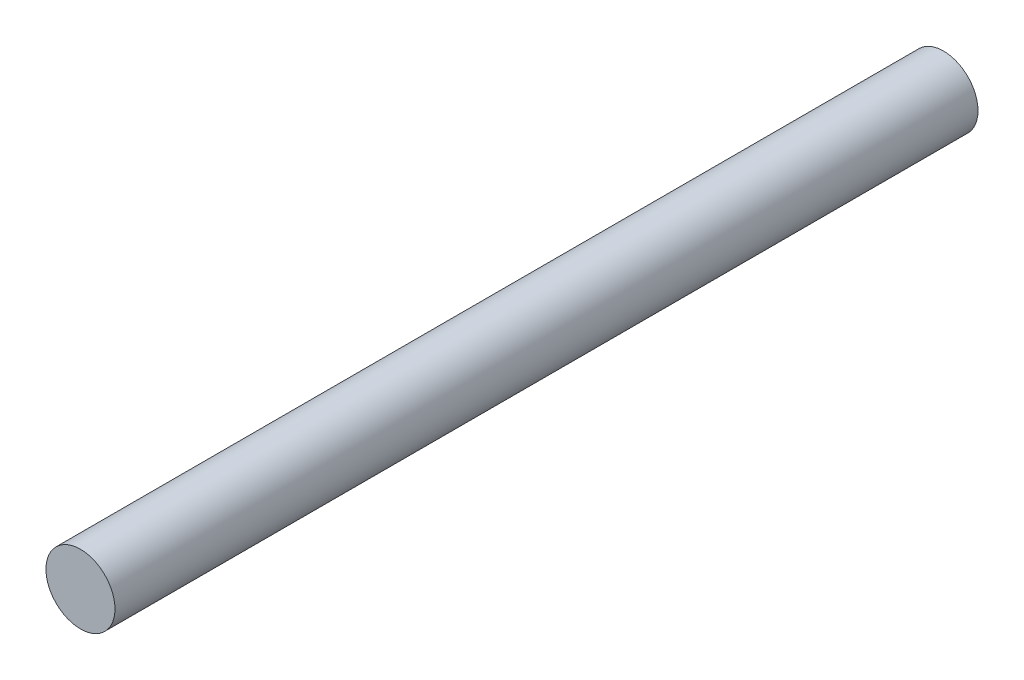
ISO-10303-21;
HEADER;
FILE_DESCRIPTION(('STEP AP214'),'2;1');
FILE_NAME('part.step','',(''),(''),'','','');
FILE_SCHEMA(('AUTOMOTIVE_DESIGN { 1 0 10303 214 1 1 1 1 }'));
ENDSEC;
DATA;
#1=APPLICATION_CONTEXT('core data for automotive mechanical design processes');
#2=APPLICATION_PROTOCOL_DEFINITION('international standard','automotive_design',2000,#1);
#3=PRODUCT_CONTEXT('',#1,'mechanical');
#4=PRODUCT('Part','Part','',(#3));
#5=PRODUCT_RELATED_PRODUCT_CATEGORY('part','',(#4));
#6=PRODUCT_DEFINITION_FORMATION('','',#4);
#7=PRODUCT_DEFINITION_CONTEXT('part definition',#1,'design');
#8=PRODUCT_DEFINITION('design','',#6,#7);
#9=PRODUCT_DEFINITION_SHAPE('','',#8);
#10=(LENGTH_UNIT() NAMED_UNIT(*) SI_UNIT(.MILLI.,.METRE.));
#11=(NAMED_UNIT(*) PLANE_ANGLE_UNIT() SI_UNIT($,.RADIAN.));
#12=(NAMED_UNIT(*) SI_UNIT($,.STERADIAN.) SOLID_ANGLE_UNIT());
#13=UNCERTAINTY_MEASURE_WITH_UNIT(LENGTH_MEASURE(1.E-05),#10,'distance_accuracy_value','');
#14=(GEOMETRIC_REPRESENTATION_CONTEXT(3) GLOBAL_UNCERTAINTY_ASSIGNED_CONTEXT((#13)) GLOBAL_UNIT_ASSIGNED_CONTEXT((#10,
#11,#12)) REPRESENTATION_CONTEXT('',''));
#15=CARTESIAN_POINT('',(0.,0.,0.));
#16=DIRECTION('',(0.,0.,1.));
#17=DIRECTION('',(1.,0.,0.));
#18=AXIS2_PLACEMENT_3D('',#15,#16,#17);
#19=CARTESIAN_POINT('',(0.,0.,125.));
#20=DIRECTION('',(0.,0.,-1.));
#21=DIRECTION('',(-1.,0.,0.));
#22=AXIS2_PLACEMENT_3D('',#19,#20,#21);
#23=CYLINDRICAL_SURFACE('',#22,5.);
#24=CARTESIAN_POINT('',(0.,0.,125.));
#25=DIRECTION('',(0.,0.,1.));
#26=DIRECTION('',(1.,0.,0.));
#27=AXIS2_PLACEMENT_3D('',#24,#25,#26);
#28=CIRCLE('',#27,5.);
#29=CARTESIAN_POINT('',(5.,0.,125.));
#30=VERTEX_POINT('',#29);
#31=EDGE_CURVE('E10',#30,#30,#28,.T.);
#32=ORIENTED_EDGE('',*,*,#31,.F.);
#33=EDGE_LOOP('',(#32));
#34=FACE_BOUND('',#33,.T.);
#35=CARTESIAN_POINT('',(0.,0.,0.));
#36=DIRECTION('',(0.,0.,1.));
#37=DIRECTION('',(1.,0.,0.));
#38=AXIS2_PLACEMENT_3D('',#35,#36,#37);
#39=CIRCLE('',#38,5.);
#40=CARTESIAN_POINT('',(5.,0.,0.));
#41=VERTEX_POINT('',#40);
#42=EDGE_CURVE('E44',#41,#41,#39,.T.);
#43=ORIENTED_EDGE('',*,*,#42,.T.);
#44=EDGE_LOOP('',(#43));
#45=FACE_BOUND('',#44,.T.);
#46=ADVANCED_FACE('F41',(#34,#45),#23,.T.);
#47=CARTESIAN_POINT('',(0.,0.,125.));
#48=DIRECTION('',(0.,0.,1.));
#49=DIRECTION('',(1.,0.,0.));
#50=AXIS2_PLACEMENT_3D('',#47,#48,#49);
#51=PLANE('',#50);
#52=ORIENTED_EDGE('',*,*,#31,.T.);
#53=EDGE_LOOP('',(#52));
#54=FACE_BOUND('',#53,.T.);
#55=ADVANCED_FACE('F58',(#54),#51,.T.);
#56=CARTESIAN_POINT('',(0.,0.,0.));
#57=DIRECTION('',(0.,0.,1.));
#58=DIRECTION('',(1.,0.,0.));
#59=AXIS2_PLACEMENT_3D('',#56,#57,#58);
#60=PLANE('',#59);
#61=ORIENTED_EDGE('',*,*,#42,.F.);
#62=EDGE_LOOP('',(#61));
#63=FACE_BOUND('',#62,.T.);
#64=ADVANCED_FACE('F56',(#63),#60,.F.);
#65=CLOSED_SHELL('',(#46,#55,#64));
#66=MANIFOLD_SOLID_BREP('B2',#65);
#67=ADVANCED_BREP_SHAPE_REPRESENTATION('',(#18,#66),#14);
#68=SHAPE_DEFINITION_REPRESENTATION(#9,#67);
ENDSEC;
END-ISO-10303-21;
